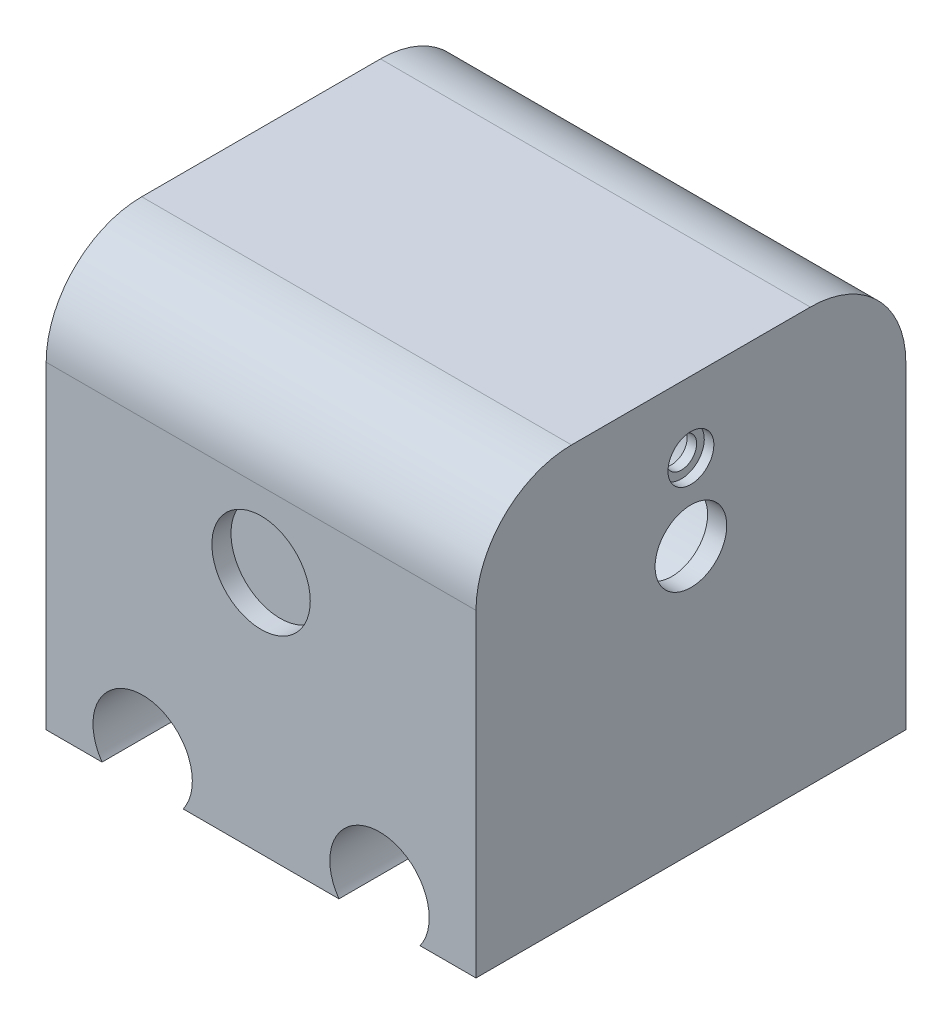
ISO-10303-21;
HEADER;
FILE_DESCRIPTION(('STEP AP214'),'2;1');
FILE_NAME('part.step','',(''),(''),'','','');
FILE_SCHEMA(('AUTOMOTIVE_DESIGN { 1 0 10303 214 1 1 1 1 }'));
ENDSEC;
DATA;
#1=APPLICATION_CONTEXT('core data for automotive mechanical design processes');
#2=APPLICATION_PROTOCOL_DEFINITION('international standard','automotive_design',2000,#1);
#3=PRODUCT_CONTEXT('',#1,'mechanical');
#4=PRODUCT('Part','Part','',(#3));
#5=PRODUCT_RELATED_PRODUCT_CATEGORY('part','',(#4));
#6=PRODUCT_DEFINITION_FORMATION('','',#4);
#7=PRODUCT_DEFINITION_CONTEXT('part definition',#1,'design');
#8=PRODUCT_DEFINITION('design','',#6,#7);
#9=PRODUCT_DEFINITION_SHAPE('','',#8);
#10=(LENGTH_UNIT() NAMED_UNIT(*) SI_UNIT(.MILLI.,.METRE.));
#11=(NAMED_UNIT(*) PLANE_ANGLE_UNIT() SI_UNIT($,.RADIAN.));
#12=(NAMED_UNIT(*) SI_UNIT($,.STERADIAN.) SOLID_ANGLE_UNIT());
#13=UNCERTAINTY_MEASURE_WITH_UNIT(LENGTH_MEASURE(1.E-05),#10,'distance_accuracy_value','');
#14=(GEOMETRIC_REPRESENTATION_CONTEXT(3) GLOBAL_UNCERTAINTY_ASSIGNED_CONTEXT((#13)) GLOBAL_UNIT_ASSIGNED_CONTEXT((#10,
#11,#12)) REPRESENTATION_CONTEXT('',''));
#15=CARTESIAN_POINT('',(0.,0.,0.));
#16=DIRECTION('',(0.,0.,1.));
#17=DIRECTION('',(1.,0.,0.));
#18=AXIS2_PLACEMENT_3D('',#15,#16,#17);
#19=CARTESIAN_POINT('',(20.7366071428571,8.,22.5));
#20=DIRECTION('',(1.,0.,0.));
#21=DIRECTION('',(0.,1.,0.));
#22=AXIS2_PLACEMENT_3D('',#19,#20,#21);
#23=CYLINDRICAL_SURFACE('',#22,1.6);
#24=CARTESIAN_POINT('',(28.7366071428571,8.,22.5));
#25=DIRECTION('',(1.,0.,0.));
#26=DIRECTION('',(0.,1.,0.));
#27=AXIS2_PLACEMENT_3D('',#24,#25,#26);
#28=CIRCLE('',#27,1.6);
#29=CARTESIAN_POINT('',(28.7366071428571,9.6,22.5));
#30=VERTEX_POINT('',#29);
#31=EDGE_CURVE('E209',#30,#30,#28,.T.);
#32=ORIENTED_EDGE('',*,*,#31,.F.);
#33=EDGE_LOOP('',(#32));
#34=FACE_BOUND('',#33,.T.);
#35=CARTESIAN_POINT('',(29.7366071428571,8.,22.5));
#36=DIRECTION('',(1.,0.,0.));
#37=DIRECTION('',(0.,1.,0.));
#38=AXIS2_PLACEMENT_3D('',#35,#36,#37);
#39=CIRCLE('',#38,1.6);
#40=CARTESIAN_POINT('',(29.7366071428571,9.6,22.5));
#41=VERTEX_POINT('',#40);
#42=EDGE_CURVE('E50',#41,#41,#39,.F.);
#43=ORIENTED_EDGE('',*,*,#42,.F.);
#44=EDGE_LOOP('',(#43));
#45=FACE_BOUND('',#44,.T.);
#46=ADVANCED_FACE('F46',(#34,#45),#23,.F.);
#47=CARTESIAN_POINT('',(31.7366071428572,0.,22.5));
#48=DIRECTION('',(-1.,0.,0.));
#49=DIRECTION('',(0.,-1.,0.));
#50=AXIS2_PLACEMENT_3D('',#47,#48,#49);
#51=CYLINDRICAL_SURFACE('',#50,12.7);
#52=CARTESIAN_POINT('',(-14.2633928571429,0.,22.5));
#53=DIRECTION('',(-1.,0.,0.));
#54=DIRECTION('',(0.,-1.,0.));
#55=AXIS2_PLACEMENT_3D('',#52,#53,#54);
#56=CIRCLE('',#55,12.7);
#57=CARTESIAN_POINT('',(-14.2633928571429,-12.7,22.5));
#58=VERTEX_POINT('',#57);
#59=EDGE_CURVE('E244',#58,#58,#56,.T.);
#60=ORIENTED_EDGE('',*,*,#59,.T.);
#61=EDGE_LOOP('',(#60));
#62=FACE_BOUND('',#61,.T.);
#63=CARTESIAN_POINT('',(28.7366071428571,0.,22.5));
#64=DIRECTION('',(1.,0.,0.));
#65=DIRECTION('',(0.,1.,0.));
#66=AXIS2_PLACEMENT_3D('',#63,#64,#65);
#67=CIRCLE('',#66,12.7);
#68=CARTESIAN_POINT('',(28.7366071428571,12.7,22.5));
#69=VERTEX_POINT('',#68);
#70=EDGE_CURVE('E187',#69,#69,#67,.F.);
#71=ORIENTED_EDGE('',*,*,#70,.F.);
#72=EDGE_LOOP('',(#71));
#73=FACE_BOUND('',#72,.T.);
#74=ADVANCED_FACE('F324',(#62,#73),#51,.F.);
#75=CARTESIAN_POINT('',(-14.2633928571429,-27.9017857142857,45.));
#76=DIRECTION('',(0.,1.,0.));
#77=DIRECTION('',(0.,0.,1.));
#78=AXIS2_PLACEMENT_3D('',#75,#76,#77);
#79=PLANE('',#78);
#80=DIRECTION('',(1.,0.,0.));
#81=VECTOR('',#80,1.);
#82=CARTESIAN_POINT('',(-14.2633928571429,-27.9017857142857,0.));
#83=LINE('',#82,#81);
#84=CARTESIAN_POINT('',(-14.2633928571429,-27.9017857142857,0.));
#85=VERTEX_POINT('',#84);
#86=CARTESIAN_POINT('',(-8.41074497346191,-27.9017857142857,0.));
#87=VERTEX_POINT('',#86);
#88=EDGE_CURVE('E160',#85,#87,#83,.T.);
#89=ORIENTED_EDGE('',*,*,#88,.T.);
#90=DIRECTION('',(0.,0.,1.));
#91=VECTOR('',#90,1.);
#92=CARTESIAN_POINT('',(-8.41074497346191,-27.9017857142857,0.));
#93=LINE('',#92,#91);
#94=CARTESIAN_POINT('',(-8.41074497346191,-27.9017857142857,45.));
#95=VERTEX_POINT('',#94);
#96=EDGE_CURVE('E163',#87,#95,#93,.T.);
#97=ORIENTED_EDGE('',*,*,#96,.T.);
#98=DIRECTION('',(1.,0.,0.));
#99=VECTOR('',#98,1.);
#100=CARTESIAN_POINT('',(-14.2633928571429,-27.9017857142857,45.));
#101=LINE('',#100,#99);
#102=CARTESIAN_POINT('',(-14.2633928571429,-27.9017857142857,45.));
#103=VERTEX_POINT('',#102);
#104=EDGE_CURVE('E277',#103,#95,#101,.T.);
#105=ORIENTED_EDGE('',*,*,#104,.F.);
#106=DIRECTION('',(0.,0.,-1.));
#107=VECTOR('',#106,1.);
#108=CARTESIAN_POINT('',(-14.2633928571429,-27.9017857142857,45.));
#109=LINE('',#108,#107);
#110=EDGE_CURVE('E138',#103,#85,#109,.T.);
#111=ORIENTED_EDGE('',*,*,#110,.T.);
#112=EDGE_LOOP('',(#89,#97,#105,#111));
#113=FACE_BOUND('',#112,.T.);
#114=ADVANCED_FACE('F302',(#113),#79,.F.);
#115=CARTESIAN_POINT('',(0.0839592591762011,-27.9017857142857,45.));
#116=VERTEX_POINT('',#115);
#117=CARTESIAN_POINT('',(16.3892550265381,-27.9017857142857,45.));
#118=VERTEX_POINT('',#117);
#119=EDGE_CURVE('E281',#116,#118,#101,.T.);
#120=ORIENTED_EDGE('',*,*,#119,.F.);
#121=DIRECTION('',(0.,0.,1.));
#122=VECTOR('',#121,1.);
#123=CARTESIAN_POINT('',(0.0839592591762002,-27.9017857142857,0.));
#124=LINE('',#123,#122);
#125=CARTESIAN_POINT('',(0.0839592591762011,-27.9017857142857,0.));
#126=VERTEX_POINT('',#125);
#127=EDGE_CURVE('E271',#116,#126,#124,.F.);
#128=ORIENTED_EDGE('',*,*,#127,.T.);
#129=CARTESIAN_POINT('',(16.3892550265381,-27.9017857142857,0.));
#130=VERTEX_POINT('',#129);
#131=EDGE_CURVE('E157',#126,#130,#83,.T.);
#132=ORIENTED_EDGE('',*,*,#131,.T.);
#133=DIRECTION('',(0.,0.,1.));
#134=VECTOR('',#133,1.);
#135=CARTESIAN_POINT('',(16.3892550265381,-27.9017857142857,0.));
#136=LINE('',#135,#134);
#137=EDGE_CURVE('E131',#130,#118,#136,.T.);
#138=ORIENTED_EDGE('',*,*,#137,.T.);
#139=EDGE_LOOP('',(#120,#128,#132,#138));
#140=FACE_BOUND('',#139,.T.);
#141=ADVANCED_FACE('F308',(#140),#79,.F.);
#142=CARTESIAN_POINT('',(-14.2633928571429,22.0982142857143,45.));
#143=DIRECTION('',(1.,0.,0.));
#144=DIRECTION('',(0.,1.,0.));
#145=AXIS2_PLACEMENT_3D('',#142,#143,#144);
#146=PLANE('',#145);
#147=ORIENTED_EDGE('',*,*,#59,.F.);
#148=EDGE_LOOP('',(#147));
#149=FACE_BOUND('',#148,.T.);
#150=DIRECTION('',(0.,0.,1.));
#151=VECTOR('',#150,1.);
#152=CARTESIAN_POINT('',(-14.2633928571429,15.4307429063089,0.));
#153=LINE('',#152,#151);
#154=CARTESIAN_POINT('',(-14.2633928571429,15.4307429063089,10.));
#155=VERTEX_POINT('',#154);
#156=CARTESIAN_POINT('',(-14.2633928571429,15.4307429063089,35.));
#157=VERTEX_POINT('',#156);
#158=EDGE_CURVE('E236',#155,#157,#153,.T.);
#159=ORIENTED_EDGE('',*,*,#158,.F.);
#160=CARTESIAN_POINT('',(-14.2633928571429,5.43074290630891,10.));
#161=DIRECTION('',(1.,0.,0.));
#162=DIRECTION('',(0.,1.,0.));
#163=AXIS2_PLACEMENT_3D('',#160,#161,#162);
#164=CIRCLE('',#163,10.);
#165=CARTESIAN_POINT('',(-14.2633928571429,5.43074290630891,0.));
#166=VERTEX_POINT('',#165);
#167=EDGE_CURVE('E56',#155,#166,#164,.F.);
#168=ORIENTED_EDGE('',*,*,#167,.T.);
#169=DIRECTION('',(0.,-1.,0.));
#170=VECTOR('',#169,1.);
#171=CARTESIAN_POINT('',(-14.2633928571429,22.0982142857143,0.));
#172=LINE('',#171,#170);
#173=EDGE_CURVE('E158',#166,#85,#172,.T.);
#174=ORIENTED_EDGE('',*,*,#173,.T.);
#175=ORIENTED_EDGE('',*,*,#110,.F.);
#176=DIRECTION('',(0.,-1.,0.));
#177=VECTOR('',#176,1.);
#178=CARTESIAN_POINT('',(-14.2633928571429,22.0982142857143,45.));
#179=LINE('',#178,#177);
#180=CARTESIAN_POINT('',(-14.2633928571429,5.43074290630891,45.));
#181=VERTEX_POINT('',#180);
#182=EDGE_CURVE('E173',#181,#103,#179,.T.);
#183=ORIENTED_EDGE('',*,*,#182,.F.);
#184=CARTESIAN_POINT('',(-14.2633928571429,5.43074290630891,35.));
#185=DIRECTION('',(1.,0.,0.));
#186=DIRECTION('',(0.,1.,0.));
#187=AXIS2_PLACEMENT_3D('',#184,#185,#186);
#188=CIRCLE('',#187,10.);
#189=EDGE_CURVE('E64',#181,#157,#188,.F.);
#190=ORIENTED_EDGE('',*,*,#189,.T.);
#191=EDGE_LOOP('',(#159,#168,#174,#175,#183,#190));
#192=FACE_BOUND('',#191,.T.);
#193=ADVANCED_FACE('F299',(#149,#192),#146,.F.);
#194=CARTESIAN_POINT('',(24.8839592591762,-27.9017857142857,45.));
#195=VERTEX_POINT('',#194);
#196=CARTESIAN_POINT('',(30.7366071428571,-27.9017857142857,45.));
#197=VERTEX_POINT('',#196);
#198=EDGE_CURVE('E146',#195,#197,#101,.T.);
#199=ORIENTED_EDGE('',*,*,#198,.F.);
#200=DIRECTION('',(0.,0.,1.));
#201=VECTOR('',#200,1.);
#202=CARTESIAN_POINT('',(24.8839592591762,-27.9017857142857,0.));
#203=LINE('',#202,#201);
#204=CARTESIAN_POINT('',(24.8839592591762,-27.9017857142857,0.));
#205=VERTEX_POINT('',#204);
#206=EDGE_CURVE('E128',#195,#205,#203,.F.);
#207=ORIENTED_EDGE('',*,*,#206,.T.);
#208=CARTESIAN_POINT('',(30.7366071428571,-27.9017857142857,0.));
#209=VERTEX_POINT('',#208);
#210=EDGE_CURVE('E144',#205,#209,#83,.T.);
#211=ORIENTED_EDGE('',*,*,#210,.T.);
#212=DIRECTION('',(0.,0.,-1.));
#213=VECTOR('',#212,1.);
#214=CARTESIAN_POINT('',(30.7366071428571,-27.9017857142857,45.));
#215=LINE('',#214,#213);
#216=EDGE_CURVE('E178',#197,#209,#215,.T.);
#217=ORIENTED_EDGE('',*,*,#216,.F.);
#218=EDGE_LOOP('',(#199,#207,#211,#217));
#219=FACE_BOUND('',#218,.T.);
#220=ADVANCED_FACE('F142',(#219),#79,.F.);
#221=CARTESIAN_POINT('',(30.7366071428571,22.0982142857143,45.));
#222=DIRECTION('',(-1.,0.,0.));
#223=DIRECTION('',(0.,-1.,0.));
#224=AXIS2_PLACEMENT_3D('',#221,#222,#223);
#225=PLANE('',#224);
#226=CARTESIAN_POINT('',(30.7366071428571,8.,22.5));
#227=DIRECTION('',(1.,0.,0.));
#228=DIRECTION('',(0.,1.,0.));
#229=AXIS2_PLACEMENT_3D('',#226,#227,#228);
#230=CIRCLE('',#229,2.4);
#231=CARTESIAN_POINT('',(30.7366071428571,10.4,22.5));
#232=VERTEX_POINT('',#231);
#233=EDGE_CURVE('E226',#232,#232,#230,.T.);
#234=ORIENTED_EDGE('',*,*,#233,.F.);
#235=EDGE_LOOP('',(#234));
#236=FACE_BOUND('',#235,.T.);
#237=DIRECTION('',(0.,1.,0.));
#238=VECTOR('',#237,1.);
#239=CARTESIAN_POINT('',(30.7366071428571,22.0982142857143,0.));
#240=LINE('',#239,#238);
#241=CARTESIAN_POINT('',(30.7366071428571,5.43074290630891,0.));
#242=VERTEX_POINT('',#241);
#243=EDGE_CURVE('E155',#209,#242,#240,.T.);
#244=ORIENTED_EDGE('',*,*,#243,.T.);
#245=CARTESIAN_POINT('',(30.7366071428571,5.43074290630891,10.));
#246=DIRECTION('',(-1.,0.,0.));
#247=DIRECTION('',(0.,-1.,0.));
#248=AXIS2_PLACEMENT_3D('',#245,#246,#247);
#249=CIRCLE('',#248,10.);
#250=CARTESIAN_POINT('',(30.7366071428571,15.4307429063089,10.));
#251=VERTEX_POINT('',#250);
#252=EDGE_CURVE('E197',#242,#251,#249,.F.);
#253=ORIENTED_EDGE('',*,*,#252,.T.);
#254=DIRECTION('',(0.,0.,1.));
#255=VECTOR('',#254,1.);
#256=CARTESIAN_POINT('',(30.7366071428571,15.4307429063089,45.));
#257=LINE('',#256,#255);
#258=CARTESIAN_POINT('',(30.7366071428571,15.4307429063089,35.));
#259=VERTEX_POINT('',#258);
#260=EDGE_CURVE('E240',#251,#259,#257,.T.);
#261=ORIENTED_EDGE('',*,*,#260,.T.);
#262=CARTESIAN_POINT('',(30.7366071428571,5.43074290630891,35.));
#263=DIRECTION('',(-1.,0.,0.));
#264=DIRECTION('',(0.,-1.,0.));
#265=AXIS2_PLACEMENT_3D('',#262,#263,#264);
#266=CIRCLE('',#265,10.);
#267=CARTESIAN_POINT('',(30.7366071428571,5.43074290630891,45.));
#268=VERTEX_POINT('',#267);
#269=EDGE_CURVE('E194',#259,#268,#266,.F.);
#270=ORIENTED_EDGE('',*,*,#269,.T.);
#271=DIRECTION('',(0.,1.,0.));
#272=VECTOR('',#271,1.);
#273=CARTESIAN_POINT('',(30.7366071428571,22.0982142857143,45.));
#274=LINE('',#273,#272);
#275=EDGE_CURVE('E181',#197,#268,#274,.T.);
#276=ORIENTED_EDGE('',*,*,#275,.F.);
#277=ORIENTED_EDGE('',*,*,#216,.T.);
#278=EDGE_LOOP('',(#244,#253,#261,#270,#276,#277));
#279=FACE_BOUND('',#278,.T.);
#280=CARTESIAN_POINT('',(30.7366071428571,0.,22.5));
#281=DIRECTION('',(1.,0.,0.));
#282=DIRECTION('',(0.,1.,0.));
#283=AXIS2_PLACEMENT_3D('',#280,#281,#282);
#284=CIRCLE('',#283,3.75);
#285=CARTESIAN_POINT('',(30.7366071428571,3.75,22.5));
#286=VERTEX_POINT('',#285);
#287=EDGE_CURVE('E212',#286,#286,#284,.T.);
#288=ORIENTED_EDGE('',*,*,#287,.F.);
#289=EDGE_LOOP('',(#288));
#290=FACE_BOUND('',#289,.T.);
#291=ADVANCED_FACE('F289',(#236,#279,#290),#225,.F.);
#292=CARTESIAN_POINT('',(0.,0.,45.));
#293=DIRECTION('',(0.,0.,1.));
#294=DIRECTION('',(1.,0.,0.));
#295=AXIS2_PLACEMENT_3D('',#292,#293,#294);
#296=PLANE('',#295);
#297=ORIENTED_EDGE('',*,*,#275,.T.);
#298=DIRECTION('',(-1.,0.,0.));
#299=VECTOR('',#298,1.);
#300=CARTESIAN_POINT('',(-14.2633928571429,5.43074290630891,45.));
#301=LINE('',#300,#299);
#302=EDGE_CURVE('E12',#268,#181,#301,.T.);
#303=ORIENTED_EDGE('',*,*,#302,.T.);
#304=ORIENTED_EDGE('',*,*,#182,.T.);
#305=ORIENTED_EDGE('',*,*,#104,.T.);
#306=CARTESIAN_POINT('',(-4.16339285714286,-24.9017857142857,45.));
#307=DIRECTION('',(0.,0.,1.));
#308=DIRECTION('',(1.,0.,0.));
#309=AXIS2_PLACEMENT_3D('',#306,#307,#308);
#310=CIRCLE('',#309,5.2);
#311=EDGE_CURVE('E148',#116,#95,#310,.T.);
#312=ORIENTED_EDGE('',*,*,#311,.F.);
#313=ORIENTED_EDGE('',*,*,#119,.T.);
#314=CARTESIAN_POINT('',(20.6366071428571,-24.9017857142857,45.));
#315=DIRECTION('',(0.,0.,1.));
#316=DIRECTION('',(1.,0.,0.));
#317=AXIS2_PLACEMENT_3D('',#314,#315,#316);
#318=CIRCLE('',#317,5.2);
#319=EDGE_CURVE('E261',#195,#118,#318,.T.);
#320=ORIENTED_EDGE('',*,*,#319,.F.);
#321=ORIENTED_EDGE('',*,*,#198,.T.);
#322=EDGE_LOOP('',(#297,#303,#304,#305,#312,#313,#320,#321));
#323=FACE_BOUND('',#322,.T.);
#324=CARTESIAN_POINT('',(8.23660714285715,-2.40178571428571,45.));
#325=DIRECTION('',(0.,0.,1.));
#326=DIRECTION('',(1.,0.,0.));
#327=AXIS2_PLACEMENT_3D('',#324,#325,#326);
#328=CIRCLE('',#327,5.15);
#329=CARTESIAN_POINT('',(13.3866071428572,-2.40178571428571,45.));
#330=VERTEX_POINT('',#329);
#331=EDGE_CURVE('E253',#330,#330,#328,.T.);
#332=ORIENTED_EDGE('',*,*,#331,.F.);
#333=EDGE_LOOP('',(#332));
#334=FACE_BOUND('',#333,.T.);
#335=ADVANCED_FACE('F286',(#323,#334),#296,.T.);
#336=CARTESIAN_POINT('',(0.,0.,0.));
#337=DIRECTION('',(0.,0.,1.));
#338=DIRECTION('',(1.,0.,0.));
#339=AXIS2_PLACEMENT_3D('',#336,#337,#338);
#340=PLANE('',#339);
#341=CARTESIAN_POINT('',(8.23660714285714,-2.40178571428571,0.));
#342=DIRECTION('',(0.,0.,-1.));
#343=DIRECTION('',(-1.,0.,0.));
#344=AXIS2_PLACEMENT_3D('',#341,#342,#343);
#345=CIRCLE('',#344,5.15);
#346=CARTESIAN_POINT('',(3.08660714285714,-2.40178571428571,0.));
#347=VERTEX_POINT('',#346);
#348=EDGE_CURVE('E248',#347,#347,#345,.T.);
#349=ORIENTED_EDGE('',*,*,#348,.F.);
#350=EDGE_LOOP('',(#349));
#351=FACE_BOUND('',#350,.T.);
#352=ORIENTED_EDGE('',*,*,#173,.F.);
#353=DIRECTION('',(1.,0.,0.));
#354=VECTOR('',#353,1.);
#355=CARTESIAN_POINT('',(0.,5.43074290630891,0.));
#356=LINE('',#355,#354);
#357=EDGE_CURVE('E191',#166,#242,#356,.T.);
#358=ORIENTED_EDGE('',*,*,#357,.T.);
#359=ORIENTED_EDGE('',*,*,#243,.F.);
#360=ORIENTED_EDGE('',*,*,#210,.F.);
#361=CARTESIAN_POINT('',(20.6366071428571,-24.9017857142857,0.));
#362=DIRECTION('',(0.,0.,1.));
#363=DIRECTION('',(1.,0.,0.));
#364=AXIS2_PLACEMENT_3D('',#361,#362,#363);
#365=CIRCLE('',#364,5.2);
#366=EDGE_CURVE('E125',#205,#130,#365,.T.);
#367=ORIENTED_EDGE('',*,*,#366,.T.);
#368=ORIENTED_EDGE('',*,*,#131,.F.);
#369=CARTESIAN_POINT('',(-4.16339285714286,-24.9017857142857,0.));
#370=DIRECTION('',(0.,0.,1.));
#371=DIRECTION('',(1.,0.,0.));
#372=AXIS2_PLACEMENT_3D('',#369,#370,#371);
#373=CIRCLE('',#372,5.2);
#374=EDGE_CURVE('E137',#126,#87,#373,.T.);
#375=ORIENTED_EDGE('',*,*,#374,.T.);
#376=ORIENTED_EDGE('',*,*,#88,.F.);
#377=EDGE_LOOP('',(#352,#358,#359,#360,#367,#368,#375,#376));
#378=FACE_BOUND('',#377,.T.);
#379=ADVANCED_FACE('F152',(#351,#378),#340,.F.);
#380=CARTESIAN_POINT('',(20.6366071428571,-24.9017857142857,0.));
#381=DIRECTION('',(0.,0.,1.));
#382=DIRECTION('',(1.,0.,0.));
#383=AXIS2_PLACEMENT_3D('',#380,#381,#382);
#384=CYLINDRICAL_SURFACE('',#383,5.2);
#385=ORIENTED_EDGE('',*,*,#366,.F.);
#386=ORIENTED_EDGE('',*,*,#206,.F.);
#387=ORIENTED_EDGE('',*,*,#319,.T.);
#388=ORIENTED_EDGE('',*,*,#137,.F.);
#389=EDGE_LOOP('',(#385,#386,#387,#388));
#390=FACE_BOUND('',#389,.T.);
#391=ADVANCED_FACE('F127',(#390),#384,.F.);
#392=CARTESIAN_POINT('',(-4.16339285714286,-24.9017857142857,0.));
#393=DIRECTION('',(0.,0.,1.));
#394=DIRECTION('',(1.,0.,0.));
#395=AXIS2_PLACEMENT_3D('',#392,#393,#394);
#396=CYLINDRICAL_SURFACE('',#395,5.2);
#397=ORIENTED_EDGE('',*,*,#374,.F.);
#398=ORIENTED_EDGE('',*,*,#127,.F.);
#399=ORIENTED_EDGE('',*,*,#311,.T.);
#400=ORIENTED_EDGE('',*,*,#96,.F.);
#401=EDGE_LOOP('',(#397,#398,#399,#400));
#402=FACE_BOUND('',#401,.T.);
#403=ADVANCED_FACE('F311',(#402),#396,.F.);
#404=CARTESIAN_POINT('',(8.23660714285715,-2.40178571428571,43.));
#405=DIRECTION('',(0.,0.,1.));
#406=DIRECTION('',(1.,0.,0.));
#407=AXIS2_PLACEMENT_3D('',#404,#405,#406);
#408=CYLINDRICAL_SURFACE('',#407,5.15);
#409=CARTESIAN_POINT('',(8.23660714285715,-2.40178571428571,43.));
#410=DIRECTION('',(0.,0.,1.));
#411=DIRECTION('',(1.,0.,0.));
#412=AXIS2_PLACEMENT_3D('',#409,#410,#411);
#413=CIRCLE('',#412,5.15);
#414=CARTESIAN_POINT('',(13.3866071428572,-2.40178571428571,43.));
#415=VERTEX_POINT('',#414);
#416=EDGE_CURVE('E257',#415,#415,#413,.T.);
#417=ORIENTED_EDGE('',*,*,#416,.F.);
#418=EDGE_LOOP('',(#417));
#419=FACE_BOUND('',#418,.T.);
#420=ORIENTED_EDGE('',*,*,#331,.T.);
#421=EDGE_LOOP('',(#420));
#422=FACE_BOUND('',#421,.T.);
#423=ADVANCED_FACE('F313',(#419,#422),#408,.F.);
#424=CARTESIAN_POINT('',(8.23660714285715,-2.40178571428571,43.));
#425=DIRECTION('',(0.,0.,1.));
#426=DIRECTION('',(1.,0.,0.));
#427=AXIS2_PLACEMENT_3D('',#424,#425,#426);
#428=PLANE('',#427);
#429=ORIENTED_EDGE('',*,*,#416,.T.);
#430=EDGE_LOOP('',(#429));
#431=FACE_BOUND('',#430,.T.);
#432=ADVANCED_FACE('F319',(#431),#428,.T.);
#433=CARTESIAN_POINT('',(8.23660714285714,-2.40178571428571,2.));
#434=DIRECTION('',(0.,0.,-1.));
#435=DIRECTION('',(-1.,0.,0.));
#436=AXIS2_PLACEMENT_3D('',#433,#434,#435);
#437=CYLINDRICAL_SURFACE('',#436,5.15);
#438=CARTESIAN_POINT('',(8.23660714285714,-2.40178571428571,2.));
#439=DIRECTION('',(0.,0.,-1.));
#440=DIRECTION('',(-1.,0.,0.));
#441=AXIS2_PLACEMENT_3D('',#438,#439,#440);
#442=CIRCLE('',#441,5.15);
#443=CARTESIAN_POINT('',(3.08660714285714,-2.40178571428571,2.));
#444=VERTEX_POINT('',#443);
#445=EDGE_CURVE('E249',#444,#444,#442,.T.);
#446=ORIENTED_EDGE('',*,*,#445,.F.);
#447=EDGE_LOOP('',(#446));
#448=FACE_BOUND('',#447,.T.);
#449=ORIENTED_EDGE('',*,*,#348,.T.);
#450=EDGE_LOOP('',(#449));
#451=FACE_BOUND('',#450,.T.);
#452=ADVANCED_FACE('F350',(#448,#451),#437,.F.);
#453=CARTESIAN_POINT('',(8.23660714285714,-2.40178571428571,2.));
#454=DIRECTION('',(0.,0.,-1.));
#455=DIRECTION('',(-1.,0.,0.));
#456=AXIS2_PLACEMENT_3D('',#453,#454,#455);
#457=PLANE('',#456);
#458=ORIENTED_EDGE('',*,*,#445,.T.);
#459=EDGE_LOOP('',(#458));
#460=FACE_BOUND('',#459,.T.);
#461=ADVANCED_FACE('F346',(#460),#457,.T.);
#462=CARTESIAN_POINT('',(31.7366071428572,15.4307429063089,0.));
#463=DIRECTION('',(0.,-1.,0.));
#464=DIRECTION('',(1.,0.,0.));
#465=AXIS2_PLACEMENT_3D('',#462,#463,#464);
#466=PLANE('',#465);
#467=ORIENTED_EDGE('',*,*,#260,.F.);
#468=DIRECTION('',(1.,0.,0.));
#469=VECTOR('',#468,1.);
#470=CARTESIAN_POINT('',(31.7366071428572,15.4307429063089,10.));
#471=LINE('',#470,#469);
#472=EDGE_CURVE('E203',#251,#155,#471,.F.);
#473=ORIENTED_EDGE('',*,*,#472,.T.);
#474=ORIENTED_EDGE('',*,*,#158,.T.);
#475=DIRECTION('',(-1.,0.,0.));
#476=VECTOR('',#475,1.);
#477=CARTESIAN_POINT('',(30.7366071428571,15.4307429063089,35.));
#478=LINE('',#477,#476);
#479=EDGE_CURVE('E200',#157,#259,#478,.F.);
#480=ORIENTED_EDGE('',*,*,#479,.T.);
#481=EDGE_LOOP('',(#467,#473,#474,#480));
#482=FACE_BOUND('',#481,.T.);
#483=ADVANCED_FACE('F294',(#482),#466,.F.);
#484=CARTESIAN_POINT('',(28.7366071428571,0.,22.5));
#485=DIRECTION('',(1.,0.,0.));
#486=DIRECTION('',(0.,1.,0.));
#487=AXIS2_PLACEMENT_3D('',#484,#485,#486);
#488=PLANE('',#487);
#489=ORIENTED_EDGE('',*,*,#31,.T.);
#490=EDGE_LOOP('',(#489));
#491=FACE_BOUND('',#490,.T.);
#492=CARTESIAN_POINT('',(28.7366071428571,0.,22.5));
#493=DIRECTION('',(1.,0.,0.));
#494=DIRECTION('',(0.,1.,0.));
#495=AXIS2_PLACEMENT_3D('',#492,#493,#494);
#496=CIRCLE('',#495,3.75);
#497=CARTESIAN_POINT('',(28.7366071428571,3.75,22.5));
#498=VERTEX_POINT('',#497);
#499=EDGE_CURVE('E218',#498,#498,#496,.T.);
#500=ORIENTED_EDGE('',*,*,#499,.T.);
#501=EDGE_LOOP('',(#500));
#502=FACE_BOUND('',#501,.T.);
#503=ORIENTED_EDGE('',*,*,#70,.T.);
#504=EDGE_LOOP('',(#503));
#505=FACE_BOUND('',#504,.T.);
#506=ADVANCED_FACE('F342',(#491,#502,#505),#488,.F.);
#507=CARTESIAN_POINT('',(28.7366071428571,0.,22.5));
#508=DIRECTION('',(1.,0.,0.));
#509=DIRECTION('',(0.,1.,0.));
#510=AXIS2_PLACEMENT_3D('',#507,#508,#509);
#511=CYLINDRICAL_SURFACE('',#510,3.75);
#512=ORIENTED_EDGE('',*,*,#499,.F.);
#513=EDGE_LOOP('',(#512));
#514=FACE_BOUND('',#513,.T.);
#515=ORIENTED_EDGE('',*,*,#287,.T.);
#516=EDGE_LOOP('',(#515));
#517=FACE_BOUND('',#516,.T.);
#518=ADVANCED_FACE('F339',(#514,#517),#511,.F.);
#519=CARTESIAN_POINT('',(0.,5.43074290630891,10.));
#520=DIRECTION('',(1.,0.,0.));
#521=DIRECTION('',(0.,1.,0.));
#522=AXIS2_PLACEMENT_3D('',#519,#520,#521);
#523=CYLINDRICAL_SURFACE('',#522,10.);
#524=ORIENTED_EDGE('',*,*,#167,.F.);
#525=ORIENTED_EDGE('',*,*,#472,.F.);
#526=ORIENTED_EDGE('',*,*,#252,.F.);
#527=ORIENTED_EDGE('',*,*,#357,.F.);
#528=EDGE_LOOP('',(#524,#525,#526,#527));
#529=FACE_BOUND('',#528,.T.);
#530=ADVANCED_FACE('F297',(#529),#523,.T.);
#531=CARTESIAN_POINT('',(0.,5.43074290630891,35.));
#532=DIRECTION('',(1.,0.,0.));
#533=DIRECTION('',(0.,1.,0.));
#534=AXIS2_PLACEMENT_3D('',#531,#532,#533);
#535=CYLINDRICAL_SURFACE('',#534,10.);
#536=ORIENTED_EDGE('',*,*,#269,.F.);
#537=ORIENTED_EDGE('',*,*,#479,.F.);
#538=ORIENTED_EDGE('',*,*,#189,.F.);
#539=ORIENTED_EDGE('',*,*,#302,.F.);
#540=EDGE_LOOP('',(#536,#537,#538,#539));
#541=FACE_BOUND('',#540,.T.);
#542=ADVANCED_FACE('F48',(#541),#535,.T.);
#543=CARTESIAN_POINT('',(29.7366071428571,8.,22.5));
#544=DIRECTION('',(1.,0.,0.));
#545=DIRECTION('',(0.,1.,0.));
#546=AXIS2_PLACEMENT_3D('',#543,#544,#545);
#547=PLANE('',#546);
#548=CARTESIAN_POINT('',(29.7366071428571,8.,22.5));
#549=DIRECTION('',(1.,0.,0.));
#550=DIRECTION('',(0.,1.,0.));
#551=AXIS2_PLACEMENT_3D('',#548,#549,#550);
#552=CIRCLE('',#551,2.4);
#553=CARTESIAN_POINT('',(29.7366071428571,10.4,22.5));
#554=VERTEX_POINT('',#553);
#555=EDGE_CURVE('E221',#554,#554,#552,.T.);
#556=ORIENTED_EDGE('',*,*,#555,.T.);
#557=EDGE_LOOP('',(#556));
#558=FACE_BOUND('',#557,.T.);
#559=ORIENTED_EDGE('',*,*,#42,.T.);
#560=EDGE_LOOP('',(#559));
#561=FACE_BOUND('',#560,.T.);
#562=ADVANCED_FACE('F380',(#558,#561),#547,.T.);
#563=CARTESIAN_POINT('',(29.7366071428571,8.,22.5));
#564=DIRECTION('',(1.,0.,0.));
#565=DIRECTION('',(0.,1.,0.));
#566=AXIS2_PLACEMENT_3D('',#563,#564,#565);
#567=CYLINDRICAL_SURFACE('',#566,2.4);
#568=ORIENTED_EDGE('',*,*,#555,.F.);
#569=EDGE_LOOP('',(#568));
#570=FACE_BOUND('',#569,.T.);
#571=ORIENTED_EDGE('',*,*,#233,.T.);
#572=EDGE_LOOP('',(#571));
#573=FACE_BOUND('',#572,.T.);
#574=ADVANCED_FACE('F337',(#570,#573),#567,.F.);
#575=CLOSED_SHELL('',(#46,#74,#114,#141,#193,#220,#291,#335,#379,#391,#403,#423,#432,#452,#461,
#483,#506,#518,#530,#542,#562,#574));
#576=MANIFOLD_SOLID_BREP('B2',#575);
#577=ADVANCED_BREP_SHAPE_REPRESENTATION('',(#18,#576),#14);
#578=SHAPE_DEFINITION_REPRESENTATION(#9,#577);
ENDSEC;
END-ISO-10303-21;
